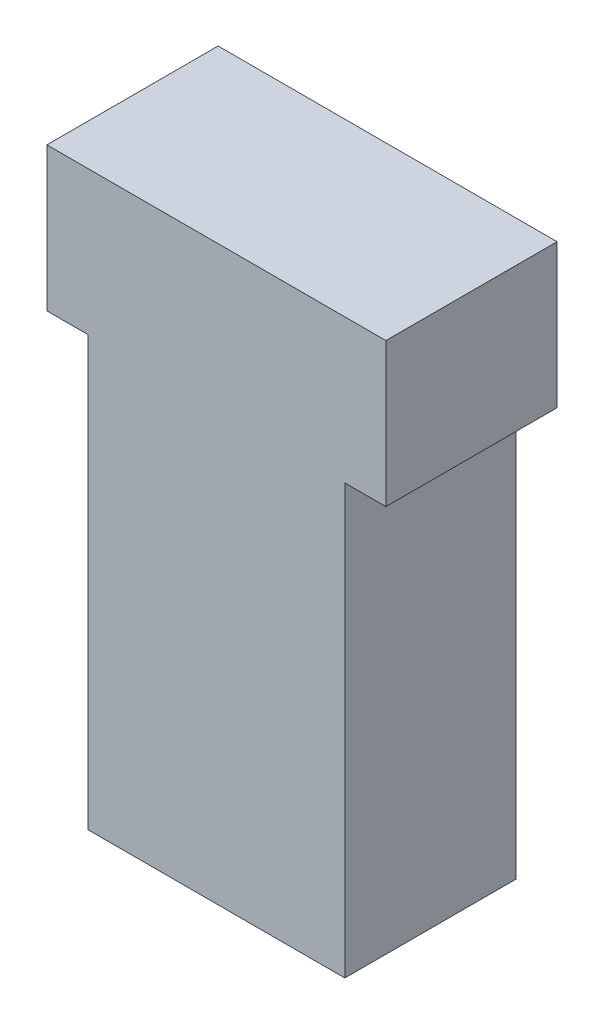
ISO-10303-21;
HEADER;
FILE_DESCRIPTION(('STEP AP214'),'2;1');
FILE_NAME('part.step','',(''),(''),'','','');
FILE_SCHEMA(('AUTOMOTIVE_DESIGN { 1 0 10303 214 1 1 1 1 }'));
ENDSEC;
DATA;
#1=APPLICATION_CONTEXT('core data for automotive mechanical design processes');
#2=APPLICATION_PROTOCOL_DEFINITION('international standard','automotive_design',2000,#1);
#3=PRODUCT_CONTEXT('',#1,'mechanical');
#4=PRODUCT('Part','Part','',(#3));
#5=PRODUCT_RELATED_PRODUCT_CATEGORY('part','',(#4));
#6=PRODUCT_DEFINITION_FORMATION('','',#4);
#7=PRODUCT_DEFINITION_CONTEXT('part definition',#1,'design');
#8=PRODUCT_DEFINITION('design','',#6,#7);
#9=PRODUCT_DEFINITION_SHAPE('','',#8);
#10=(LENGTH_UNIT() NAMED_UNIT(*) SI_UNIT(.MILLI.,.METRE.));
#11=(NAMED_UNIT(*) PLANE_ANGLE_UNIT() SI_UNIT($,.RADIAN.));
#12=(NAMED_UNIT(*) SI_UNIT($,.STERADIAN.) SOLID_ANGLE_UNIT());
#13=UNCERTAINTY_MEASURE_WITH_UNIT(LENGTH_MEASURE(1.E-05),#10,'distance_accuracy_value','');
#14=(GEOMETRIC_REPRESENTATION_CONTEXT(3) GLOBAL_UNCERTAINTY_ASSIGNED_CONTEXT((#13)) GLOBAL_UNIT_ASSIGNED_CONTEXT((#10,
#11,#12)) REPRESENTATION_CONTEXT('',''));
#15=CARTESIAN_POINT('',(0.,0.,0.));
#16=DIRECTION('',(0.,0.,1.));
#17=DIRECTION('',(1.,0.,0.));
#18=AXIS2_PLACEMENT_3D('',#15,#16,#17);
#19=CARTESIAN_POINT('',(134.219744279938,101.758469982888,143.086328634145));
#20=DIRECTION('',(1.,0.,0.));
#21=DIRECTION('',(0.,1.,0.));
#22=AXIS2_PLACEMENT_3D('',#19,#20,#21);
#23=PLANE('',#22);
#24=DIRECTION('',(0.,0.,-1.));
#25=VECTOR('',#24,1.);
#26=CARTESIAN_POINT('',(134.219744279938,101.15704329235,142.648955771372));
#27=LINE('',#26,#25);
#28=CARTESIAN_POINT('',(134.219744279938,101.15704329235,143.651470551509));
#29=VERTEX_POINT('',#28);
#30=CARTESIAN_POINT('',(134.219744279938,101.15704329235,143.151470551509));
#31=VERTEX_POINT('',#30);
#32=EDGE_CURVE('E66',#29,#31,#27,.T.);
#33=ORIENTED_EDGE('',*,*,#32,.F.);
#34=DIRECTION('',(0.,-1.,0.));
#35=VECTOR('',#34,1.);
#36=CARTESIAN_POINT('',(134.219744279938,101.904744628566,143.651470551509));
#37=LINE('',#36,#35);
#38=CARTESIAN_POINT('',(134.219744279938,99.9047446285661,143.651470551509));
#39=VERTEX_POINT('',#38);
#40=EDGE_CURVE('E11',#29,#39,#37,.T.);
#41=ORIENTED_EDGE('',*,*,#40,.T.);
#42=DIRECTION('',(0.,0.,-1.));
#43=VECTOR('',#42,1.);
#44=CARTESIAN_POINT('',(134.219744279938,99.9047446285661,143.651470551509));
#45=LINE('',#44,#43);
#46=CARTESIAN_POINT('',(134.219744279938,99.9047446285661,143.151470551509));
#47=VERTEX_POINT('',#46);
#48=EDGE_CURVE('E48',#39,#47,#45,.T.);
#49=ORIENTED_EDGE('',*,*,#48,.T.);
#50=DIRECTION('',(0.,1.,0.));
#51=VECTOR('',#50,1.);
#52=CARTESIAN_POINT('',(134.219744279938,99.9047446285661,143.151470551509));
#53=LINE('',#52,#51);
#54=EDGE_CURVE('E181',#47,#31,#53,.T.);
#55=ORIENTED_EDGE('',*,*,#54,.T.);
#56=EDGE_LOOP('',(#33,#41,#49,#55));
#57=FACE_BOUND('',#56,.T.);
#58=ADVANCED_FACE('F44',(#57),#23,.T.);
#59=CARTESIAN_POINT('',(134.219744279938,99.9047446285661,143.651470551509));
#60=DIRECTION('',(0.,-1.,0.));
#61=DIRECTION('',(0.,0.,-1.));
#62=AXIS2_PLACEMENT_3D('',#59,#60,#61);
#63=PLANE('',#62);
#64=DIRECTION('',(-1.,0.,0.));
#65=VECTOR('',#64,1.);
#66=CARTESIAN_POINT('',(134.219744279938,99.9047446285661,143.651470551509));
#67=LINE('',#66,#65);
#68=CARTESIAN_POINT('',(133.469744279938,99.9047446285661,143.651470551509));
#69=VERTEX_POINT('',#68);
#70=EDGE_CURVE('E177',#39,#69,#67,.T.);
#71=ORIENTED_EDGE('',*,*,#70,.T.);
#72=DIRECTION('',(0.,0.,-1.));
#73=VECTOR('',#72,1.);
#74=CARTESIAN_POINT('',(133.469744279938,99.9047446285661,143.651470551509));
#75=LINE('',#74,#73);
#76=CARTESIAN_POINT('',(133.469744279938,99.9047446285661,143.151470551509));
#77=VERTEX_POINT('',#76);
#78=EDGE_CURVE('E182',#69,#77,#75,.T.);
#79=ORIENTED_EDGE('',*,*,#78,.T.);
#80=DIRECTION('',(-1.,0.,0.));
#81=VECTOR('',#80,1.);
#82=CARTESIAN_POINT('',(134.219744279938,99.9047446285661,143.151470551509));
#83=LINE('',#82,#81);
#84=EDGE_CURVE('E168',#47,#77,#83,.T.);
#85=ORIENTED_EDGE('',*,*,#84,.F.);
#86=ORIENTED_EDGE('',*,*,#48,.F.);
#87=EDGE_LOOP('',(#71,#79,#85,#86));
#88=FACE_BOUND('',#87,.T.);
#89=ADVANCED_FACE('F228',(#88),#63,.T.);
#90=CARTESIAN_POINT('',(133.469744279938,101.758469982888,143.086328634145));
#91=DIRECTION('',(1.,0.,0.));
#92=DIRECTION('',(0.,1.,0.));
#93=AXIS2_PLACEMENT_3D('',#90,#91,#92);
#94=PLANE('',#93);
#95=DIRECTION('',(0.,1.,0.));
#96=VECTOR('',#95,1.);
#97=CARTESIAN_POINT('',(133.469744279938,99.9047446285661,143.151470551509));
#98=LINE('',#97,#96);
#99=CARTESIAN_POINT('',(133.469744279938,101.15704329235,143.151470551509));
#100=VERTEX_POINT('',#99);
#101=EDGE_CURVE('E132',#77,#100,#98,.T.);
#102=ORIENTED_EDGE('',*,*,#101,.F.);
#103=ORIENTED_EDGE('',*,*,#78,.F.);
#104=DIRECTION('',(0.,-1.,0.));
#105=VECTOR('',#104,1.);
#106=CARTESIAN_POINT('',(133.469744279938,101.904744628566,143.651470551509));
#107=LINE('',#106,#105);
#108=CARTESIAN_POINT('',(133.469744279938,101.15704329235,143.651470551509));
#109=VERTEX_POINT('',#108);
#110=EDGE_CURVE('E183',#109,#69,#107,.T.);
#111=ORIENTED_EDGE('',*,*,#110,.F.);
#112=DIRECTION('',(0.,0.,-1.));
#113=VECTOR('',#112,1.);
#114=CARTESIAN_POINT('',(133.469744279938,101.15704329235,142.648955771372));
#115=LINE('',#114,#113);
#116=EDGE_CURVE('E146',#109,#100,#115,.T.);
#117=ORIENTED_EDGE('',*,*,#116,.T.);
#118=EDGE_LOOP('',(#102,#103,#111,#117));
#119=FACE_BOUND('',#118,.T.);
#120=ADVANCED_FACE('F230',(#119),#94,.F.);
#121=CARTESIAN_POINT('',(137.094744279938,101.15704329235,142.211582908599));
#122=DIRECTION('',(0.,-1.,0.));
#123=DIRECTION('',(0.,0.,-1.));
#124=AXIS2_PLACEMENT_3D('',#121,#122,#123);
#125=PLANE('',#124);
#126=ORIENTED_EDGE('',*,*,#116,.F.);
#127=DIRECTION('',(1.,0.,0.));
#128=VECTOR('',#127,1.);
#129=CARTESIAN_POINT('',(135.717244279938,101.15704329235,143.651470551509));
#130=LINE('',#129,#128);
#131=CARTESIAN_POINT('',(133.349744279938,101.15704329235,143.651470551509));
#132=VERTEX_POINT('',#131);
#133=EDGE_CURVE('E142',#132,#109,#130,.T.);
#134=ORIENTED_EDGE('',*,*,#133,.F.);
#135=DIRECTION('',(0.,0.,-1.));
#136=VECTOR('',#135,1.);
#137=CARTESIAN_POINT('',(133.349744279938,101.15704329235,142.648955771372));
#138=LINE('',#137,#136);
#139=CARTESIAN_POINT('',(133.349744279938,101.15704329235,143.151470551509));
#140=VERTEX_POINT('',#139);
#141=EDGE_CURVE('E139',#132,#140,#138,.T.);
#142=ORIENTED_EDGE('',*,*,#141,.T.);
#143=DIRECTION('',(-1.,0.,0.));
#144=VECTOR('',#143,1.);
#145=CARTESIAN_POINT('',(135.717244279938,101.15704329235,143.151470551509));
#146=LINE('',#145,#144);
#147=EDGE_CURVE('E123',#100,#140,#146,.T.);
#148=ORIENTED_EDGE('',*,*,#147,.F.);
#149=EDGE_LOOP('',(#126,#134,#142,#148));
#150=FACE_BOUND('',#149,.T.);
#151=ADVANCED_FACE('F140',(#150),#125,.T.);
#152=CARTESIAN_POINT('',(133.349744279938,101.758469982888,143.086328634145));
#153=DIRECTION('',(1.,0.,0.));
#154=DIRECTION('',(0.,1.,0.));
#155=AXIS2_PLACEMENT_3D('',#152,#153,#154);
#156=PLANE('',#155);
#157=ORIENTED_EDGE('',*,*,#141,.F.);
#158=DIRECTION('',(0.,-1.,0.));
#159=VECTOR('',#158,1.);
#160=CARTESIAN_POINT('',(133.349744279938,101.904744628566,143.651470551509));
#161=LINE('',#160,#159);
#162=CARTESIAN_POINT('',(133.349744279938,101.57704329235,143.651470551509));
#163=VERTEX_POINT('',#162);
#164=EDGE_CURVE('E201',#163,#132,#161,.T.);
#165=ORIENTED_EDGE('',*,*,#164,.F.);
#166=DIRECTION('',(0.,0.,1.));
#167=VECTOR('',#166,1.);
#168=CARTESIAN_POINT('',(133.349744279938,101.57704329235,142.211582908599));
#169=LINE('',#168,#167);
#170=CARTESIAN_POINT('',(133.349744279938,101.57704329235,143.151470551509));
#171=VERTEX_POINT('',#170);
#172=EDGE_CURVE('E147',#171,#163,#169,.T.);
#173=ORIENTED_EDGE('',*,*,#172,.F.);
#174=DIRECTION('',(0.,1.,0.));
#175=VECTOR('',#174,1.);
#176=CARTESIAN_POINT('',(133.349744279938,99.9047446285661,143.151470551509));
#177=LINE('',#176,#175);
#178=EDGE_CURVE('E128',#140,#171,#177,.T.);
#179=ORIENTED_EDGE('',*,*,#178,.F.);
#180=EDGE_LOOP('',(#157,#165,#173,#179));
#181=FACE_BOUND('',#180,.T.);
#182=ADVANCED_FACE('F149',(#181),#156,.F.);
#183=CARTESIAN_POINT('',(133.349744279938,101.57704329235,142.211582908599));
#184=DIRECTION('',(0.,1.,0.));
#185=DIRECTION('',(1.,0.,0.));
#186=AXIS2_PLACEMENT_3D('',#183,#184,#185);
#187=PLANE('',#186);
#188=DIRECTION('',(1.,0.,0.));
#189=VECTOR('',#188,1.);
#190=CARTESIAN_POINT('',(133.844744279938,101.57704329235,143.151470551509));
#191=LINE('',#190,#189);
#192=CARTESIAN_POINT('',(134.339744279938,101.57704329235,143.151470551509));
#193=VERTEX_POINT('',#192);
#194=EDGE_CURVE('E153',#171,#193,#191,.T.);
#195=ORIENTED_EDGE('',*,*,#194,.F.);
#196=ORIENTED_EDGE('',*,*,#172,.T.);
#197=DIRECTION('',(-1.,0.,0.));
#198=VECTOR('',#197,1.);
#199=CARTESIAN_POINT('',(133.844744279938,101.57704329235,143.651470551509));
#200=LINE('',#199,#198);
#201=CARTESIAN_POINT('',(134.339744279938,101.57704329235,143.651470551509));
#202=VERTEX_POINT('',#201);
#203=EDGE_CURVE('E204',#202,#163,#200,.T.);
#204=ORIENTED_EDGE('',*,*,#203,.F.);
#205=DIRECTION('',(0.,0.,1.));
#206=VECTOR('',#205,1.);
#207=CARTESIAN_POINT('',(134.339744279938,101.57704329235,142.211582908599));
#208=LINE('',#207,#206);
#209=EDGE_CURVE('E173',#193,#202,#208,.T.);
#210=ORIENTED_EDGE('',*,*,#209,.F.);
#211=EDGE_LOOP('',(#195,#196,#204,#210));
#212=FACE_BOUND('',#211,.T.);
#213=ADVANCED_FACE('F218',(#212),#187,.T.);
#214=CARTESIAN_POINT('',(134.339744279938,101.904744628566,143.651470551509));
#215=DIRECTION('',(0.,0.,1.));
#216=DIRECTION('',(1.,0.,0.));
#217=AXIS2_PLACEMENT_3D('',#214,#215,#216);
#218=PLANE('',#217);
#219=DIRECTION('',(0.,-1.,0.));
#220=VECTOR('',#219,1.);
#221=CARTESIAN_POINT('',(134.339744279938,101.904744628566,143.651470551509));
#222=LINE('',#221,#220);
#223=CARTESIAN_POINT('',(134.339744279938,101.15704329235,143.651470551509));
#224=VERTEX_POINT('',#223);
#225=EDGE_CURVE('E170',#202,#224,#222,.T.);
#226=ORIENTED_EDGE('',*,*,#225,.F.);
#227=ORIENTED_EDGE('',*,*,#203,.T.);
#228=ORIENTED_EDGE('',*,*,#164,.T.);
#229=ORIENTED_EDGE('',*,*,#133,.T.);
#230=ORIENTED_EDGE('',*,*,#110,.T.);
#231=ORIENTED_EDGE('',*,*,#70,.F.);
#232=ORIENTED_EDGE('',*,*,#40,.F.);
#233=DIRECTION('',(1.,0.,0.));
#234=VECTOR('',#233,1.);
#235=CARTESIAN_POINT('',(135.717244279938,101.15704329235,143.651470551509));
#236=LINE('',#235,#234);
#237=EDGE_CURVE('E164',#29,#224,#236,.T.);
#238=ORIENTED_EDGE('',*,*,#237,.T.);
#239=EDGE_LOOP('',(#226,#227,#228,#229,#230,#231,#232,#238));
#240=FACE_BOUND('',#239,.T.);
#241=ADVANCED_FACE('F214',(#240),#218,.T.);
#242=CARTESIAN_POINT('',(137.094744279938,101.15704329235,142.211582908599));
#243=DIRECTION('',(0.,-1.,0.));
#244=DIRECTION('',(0.,0.,-1.));
#245=AXIS2_PLACEMENT_3D('',#242,#243,#244);
#246=PLANE('',#245);
#247=DIRECTION('',(0.,0.,-1.));
#248=VECTOR('',#247,1.);
#249=CARTESIAN_POINT('',(134.339744279938,101.15704329235,142.648955771372));
#250=LINE('',#249,#248);
#251=CARTESIAN_POINT('',(134.339744279938,101.15704329235,143.151470551509));
#252=VERTEX_POINT('',#251);
#253=EDGE_CURVE('E174',#224,#252,#250,.T.);
#254=ORIENTED_EDGE('',*,*,#253,.F.);
#255=ORIENTED_EDGE('',*,*,#237,.F.);
#256=ORIENTED_EDGE('',*,*,#32,.T.);
#257=DIRECTION('',(-1.,0.,0.));
#258=VECTOR('',#257,1.);
#259=CARTESIAN_POINT('',(135.717244279938,101.15704329235,143.151470551509));
#260=LINE('',#259,#258);
#261=EDGE_CURVE('E165',#252,#31,#260,.T.);
#262=ORIENTED_EDGE('',*,*,#261,.F.);
#263=EDGE_LOOP('',(#254,#255,#256,#262));
#264=FACE_BOUND('',#263,.T.);
#265=ADVANCED_FACE('F246',(#264),#246,.T.);
#266=CARTESIAN_POINT('',(134.339744279938,99.9047446285661,143.151470551509));
#267=DIRECTION('',(0.,0.,-1.));
#268=DIRECTION('',(-1.,0.,0.));
#269=AXIS2_PLACEMENT_3D('',#266,#267,#268);
#270=PLANE('',#269);
#271=DIRECTION('',(0.,1.,0.));
#272=VECTOR('',#271,1.);
#273=CARTESIAN_POINT('',(134.339744279938,99.9047446285661,143.151470551509));
#274=LINE('',#273,#272);
#275=EDGE_CURVE('E159',#252,#193,#274,.T.);
#276=ORIENTED_EDGE('',*,*,#275,.F.);
#277=ORIENTED_EDGE('',*,*,#261,.T.);
#278=ORIENTED_EDGE('',*,*,#54,.F.);
#279=ORIENTED_EDGE('',*,*,#84,.T.);
#280=ORIENTED_EDGE('',*,*,#101,.T.);
#281=ORIENTED_EDGE('',*,*,#147,.T.);
#282=ORIENTED_EDGE('',*,*,#178,.T.);
#283=ORIENTED_EDGE('',*,*,#194,.T.);
#284=EDGE_LOOP('',(#276,#277,#278,#279,#280,#281,#282,#283));
#285=FACE_BOUND('',#284,.T.);
#286=ADVANCED_FACE('F46',(#285),#270,.T.);
#287=CARTESIAN_POINT('',(134.339744279938,101.758469982888,143.086328634145));
#288=DIRECTION('',(1.,0.,0.));
#289=DIRECTION('',(0.,1.,0.));
#290=AXIS2_PLACEMENT_3D('',#287,#288,#289);
#291=PLANE('',#290);
#292=ORIENTED_EDGE('',*,*,#275,.T.);
#293=ORIENTED_EDGE('',*,*,#209,.T.);
#294=ORIENTED_EDGE('',*,*,#225,.T.);
#295=ORIENTED_EDGE('',*,*,#253,.T.);
#296=EDGE_LOOP('',(#292,#293,#294,#295));
#297=FACE_BOUND('',#296,.T.);
#298=ADVANCED_FACE('F253',(#297),#291,.T.);
#299=CLOSED_SHELL('',(#58,#89,#120,#151,#182,#213,#241,#265,#286,#298));
#300=MANIFOLD_SOLID_BREP('B2',#299);
#301=ADVANCED_BREP_SHAPE_REPRESENTATION('',(#18,#300),#14);
#302=SHAPE_DEFINITION_REPRESENTATION(#9,#301);
ENDSEC;
END-ISO-10303-21;
